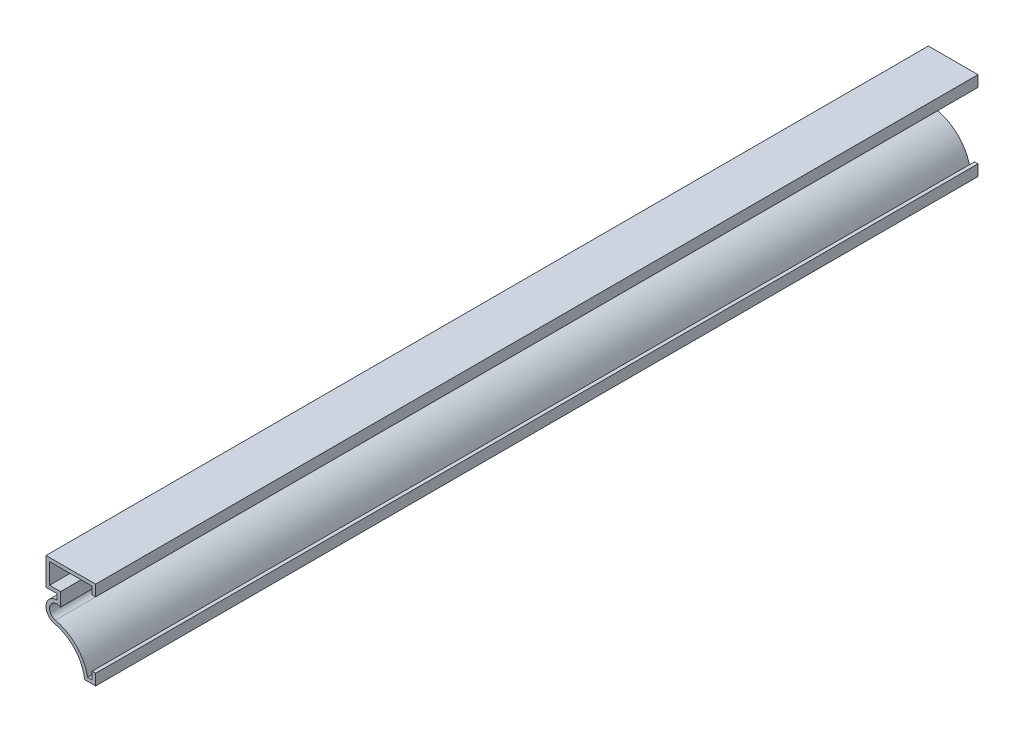
ISO-10303-21;
HEADER;
FILE_DESCRIPTION(('STEP AP214'),'2;1');
FILE_NAME('part.step','',(''),(''),'','','');
FILE_SCHEMA(('AUTOMOTIVE_DESIGN { 1 0 10303 214 1 1 1 1 }'));
ENDSEC;
DATA;
#1=APPLICATION_CONTEXT('core data for automotive mechanical design processes');
#2=APPLICATION_PROTOCOL_DEFINITION('international standard','automotive_design',2000,#1);
#3=PRODUCT_CONTEXT('',#1,'mechanical');
#4=PRODUCT('Part','Part','',(#3));
#5=PRODUCT_RELATED_PRODUCT_CATEGORY('part','',(#4));
#6=PRODUCT_DEFINITION_FORMATION('','',#4);
#7=PRODUCT_DEFINITION_CONTEXT('part definition',#1,'design');
#8=PRODUCT_DEFINITION('design','',#6,#7);
#9=PRODUCT_DEFINITION_SHAPE('','',#8);
#10=(LENGTH_UNIT() NAMED_UNIT(*) SI_UNIT(.MILLI.,.METRE.));
#11=(NAMED_UNIT(*) PLANE_ANGLE_UNIT() SI_UNIT($,.RADIAN.));
#12=(NAMED_UNIT(*) SI_UNIT($,.STERADIAN.) SOLID_ANGLE_UNIT());
#13=UNCERTAINTY_MEASURE_WITH_UNIT(LENGTH_MEASURE(1.E-05),#10,'distance_accuracy_value','');
#14=(GEOMETRIC_REPRESENTATION_CONTEXT(3) GLOBAL_UNCERTAINTY_ASSIGNED_CONTEXT((#13)) GLOBAL_UNIT_ASSIGNED_CONTEXT((#10,
#11,#12)) REPRESENTATION_CONTEXT('',''));
#15=CARTESIAN_POINT('',(0.,0.,0.));
#16=DIRECTION('',(0.,0.,1.));
#17=DIRECTION('',(1.,0.,0.));
#18=AXIS2_PLACEMENT_3D('',#15,#16,#17);
#19=CARTESIAN_POINT('',(-1.016,22.225,-254.));
#20=DIRECTION('',(-1.,0.,0.));
#21=DIRECTION('',(0.,0.,1.));
#22=AXIS2_PLACEMENT_3D('',#19,#20,#21);
#23=PLANE('',#22);
#24=DIRECTION('',(0.,1.,0.));
#25=VECTOR('',#24,1.);
#26=CARTESIAN_POINT('',(-1.016,22.225,0.));
#27=LINE('',#26,#25);
#28=CARTESIAN_POINT('',(-1.016,24.384,0.));
#29=VERTEX_POINT('',#28);
#30=CARTESIAN_POINT('',(-1.016,22.225,0.));
#31=VERTEX_POINT('',#30);
#32=EDGE_CURVE('E203',#29,#31,#27,.F.);
#33=ORIENTED_EDGE('',*,*,#32,.F.);
#34=DIRECTION('',(0.,0.,1.));
#35=VECTOR('',#34,1.);
#36=CARTESIAN_POINT('',(-1.016,24.384,-254.));
#37=LINE('',#36,#35);
#38=CARTESIAN_POINT('',(-1.016,24.384,-254.));
#39=VERTEX_POINT('',#38);
#40=EDGE_CURVE('E11',#39,#29,#37,.T.);
#41=ORIENTED_EDGE('',*,*,#40,.F.);
#42=DIRECTION('',(0.,1.,0.));
#43=VECTOR('',#42,1.);
#44=CARTESIAN_POINT('',(-1.016,22.225,-254.));
#45=LINE('',#44,#43);
#46=CARTESIAN_POINT('',(-1.016,22.225,-254.));
#47=VERTEX_POINT('',#46);
#48=EDGE_CURVE('E249',#39,#47,#45,.F.);
#49=ORIENTED_EDGE('',*,*,#48,.T.);
#50=DIRECTION('',(0.,0.,1.));
#51=VECTOR('',#50,1.);
#52=CARTESIAN_POINT('',(-1.016,22.225,-254.));
#53=LINE('',#52,#51);
#54=EDGE_CURVE('E38',#47,#31,#53,.T.);
#55=ORIENTED_EDGE('',*,*,#54,.T.);
#56=EDGE_LOOP('',(#33,#41,#49,#55));
#57=FACE_BOUND('',#56,.T.);
#58=ADVANCED_FACE('F35',(#57),#23,.T.);
#59=CARTESIAN_POINT('',(0.,24.384,-254.));
#60=DIRECTION('',(0.,-1.,0.));
#61=DIRECTION('',(1.,0.,0.));
#62=AXIS2_PLACEMENT_3D('',#59,#60,#61);
#63=PLANE('',#62);
#64=DIRECTION('',(1.,0.,0.));
#65=VECTOR('',#64,1.);
#66=CARTESIAN_POINT('',(0.,24.384,0.));
#67=LINE('',#66,#65);
#68=CARTESIAN_POINT('',(-13.2715,24.384,0.));
#69=VERTEX_POINT('',#68);
#70=EDGE_CURVE('E247',#69,#29,#67,.T.);
#71=ORIENTED_EDGE('',*,*,#70,.F.);
#72=DIRECTION('',(0.,0.,1.));
#73=VECTOR('',#72,1.);
#74=CARTESIAN_POINT('',(-13.2715,24.384,-254.));
#75=LINE('',#74,#73);
#76=CARTESIAN_POINT('',(-13.2715,24.384,-254.));
#77=VERTEX_POINT('',#76);
#78=EDGE_CURVE('E44',#77,#69,#75,.T.);
#79=ORIENTED_EDGE('',*,*,#78,.F.);
#80=DIRECTION('',(1.,0.,0.));
#81=VECTOR('',#80,1.);
#82=CARTESIAN_POINT('',(0.,24.384,-254.));
#83=LINE('',#82,#81);
#84=EDGE_CURVE('E193',#77,#39,#83,.T.);
#85=ORIENTED_EDGE('',*,*,#84,.T.);
#86=ORIENTED_EDGE('',*,*,#40,.T.);
#87=EDGE_LOOP('',(#71,#79,#85,#86));
#88=FACE_BOUND('',#87,.T.);
#89=ADVANCED_FACE('F298',(#88),#63,.T.);
#90=CARTESIAN_POINT('',(-13.2715,25.4,-254.));
#91=DIRECTION('',(1.,0.,0.));
#92=DIRECTION('',(0.,1.,0.));
#93=AXIS2_PLACEMENT_3D('',#90,#91,#92);
#94=PLANE('',#93);
#95=DIRECTION('',(0.,1.,0.));
#96=VECTOR('',#95,1.);
#97=CARTESIAN_POINT('',(-13.2715,25.4,0.));
#98=LINE('',#97,#96);
#99=CARTESIAN_POINT('',(-13.2715,18.4785,0.));
#100=VERTEX_POINT('',#99);
#101=EDGE_CURVE('E181',#100,#69,#98,.T.);
#102=ORIENTED_EDGE('',*,*,#101,.F.);
#103=DIRECTION('',(0.,0.,1.));
#104=VECTOR('',#103,1.);
#105=CARTESIAN_POINT('',(-13.2715,18.4785,-254.));
#106=LINE('',#105,#104);
#107=CARTESIAN_POINT('',(-13.2715,18.4785,-254.));
#108=VERTEX_POINT('',#107);
#109=EDGE_CURVE('E176',#108,#100,#106,.T.);
#110=ORIENTED_EDGE('',*,*,#109,.F.);
#111=DIRECTION('',(0.,1.,0.));
#112=VECTOR('',#111,1.);
#113=CARTESIAN_POINT('',(-13.2715,25.4,-254.));
#114=LINE('',#113,#112);
#115=EDGE_CURVE('E179',#108,#77,#114,.T.);
#116=ORIENTED_EDGE('',*,*,#115,.T.);
#117=ORIENTED_EDGE('',*,*,#78,.T.);
#118=EDGE_LOOP('',(#102,#110,#116,#117));
#119=FACE_BOUND('',#118,.T.);
#120=ADVANCED_FACE('F178',(#119),#94,.T.);
#121=CARTESIAN_POINT('',(-14.2875,18.4785,-254.));
#122=DIRECTION('',(0.,1.,0.));
#123=DIRECTION('',(-1.,0.,0.));
#124=AXIS2_PLACEMENT_3D('',#121,#122,#123);
#125=PLANE('',#124);
#126=DIRECTION('',(-1.,0.,0.));
#127=VECTOR('',#126,1.);
#128=CARTESIAN_POINT('',(-14.2875,18.4785,0.));
#129=LINE('',#128,#127);
#130=CARTESIAN_POINT('',(-10.0965,18.4785,0.));
#131=VERTEX_POINT('',#130);
#132=EDGE_CURVE('E244',#131,#100,#129,.T.);
#133=ORIENTED_EDGE('',*,*,#132,.F.);
#134=DIRECTION('',(0.,0.,1.));
#135=VECTOR('',#134,1.);
#136=CARTESIAN_POINT('',(-10.0965,18.4785,-254.));
#137=LINE('',#136,#135);
#138=CARTESIAN_POINT('',(-10.0965,18.4785,-254.));
#139=VERTEX_POINT('',#138);
#140=EDGE_CURVE('E186',#139,#131,#137,.T.);
#141=ORIENTED_EDGE('',*,*,#140,.F.);
#142=DIRECTION('',(-1.,0.,0.));
#143=VECTOR('',#142,1.);
#144=CARTESIAN_POINT('',(-14.2875,18.4785,-254.));
#145=LINE('',#144,#143);
#146=EDGE_CURVE('E191',#139,#108,#145,.T.);
#147=ORIENTED_EDGE('',*,*,#146,.T.);
#148=ORIENTED_EDGE('',*,*,#109,.T.);
#149=EDGE_LOOP('',(#133,#141,#147,#148));
#150=FACE_BOUND('',#149,.T.);
#151=ADVANCED_FACE('F195',(#150),#125,.T.);
#152=CARTESIAN_POINT('',(-10.0965,17.4625,-254.));
#153=DIRECTION('',(1.,0.,0.));
#154=DIRECTION('',(0.,1.,0.));
#155=AXIS2_PLACEMENT_3D('',#152,#153,#154);
#156=PLANE('',#155);
#157=DIRECTION('',(0.,1.,0.));
#158=VECTOR('',#157,1.);
#159=CARTESIAN_POINT('',(-10.0965,17.4625,0.));
#160=LINE('',#159,#158);
#161=CARTESIAN_POINT('',(-10.0965,14.605,0.));
#162=VERTEX_POINT('',#161);
#163=EDGE_CURVE('E241',#162,#131,#160,.T.);
#164=ORIENTED_EDGE('',*,*,#163,.F.);
#165=DIRECTION('',(0.,0.,1.));
#166=VECTOR('',#165,1.);
#167=CARTESIAN_POINT('',(-10.0965,14.605,-254.));
#168=LINE('',#167,#166);
#169=CARTESIAN_POINT('',(-10.0965,14.605,-254.));
#170=VERTEX_POINT('',#169);
#171=EDGE_CURVE('E253',#170,#162,#168,.T.);
#172=ORIENTED_EDGE('',*,*,#171,.F.);
#173=DIRECTION('',(0.,1.,0.));
#174=VECTOR('',#173,1.);
#175=CARTESIAN_POINT('',(-10.0965,17.4625,-254.));
#176=LINE('',#175,#174);
#177=EDGE_CURVE('E196',#170,#139,#176,.T.);
#178=ORIENTED_EDGE('',*,*,#177,.T.);
#179=ORIENTED_EDGE('',*,*,#140,.T.);
#180=EDGE_LOOP('',(#164,#172,#178,#179));
#181=FACE_BOUND('',#180,.T.);
#182=ADVANCED_FACE('F311',(#181),#156,.T.);
#183=CARTESIAN_POINT('',(-11.1125,12.7,-254.));
#184=DIRECTION('',(0.,0.,1.));
#185=DIRECTION('',(1.,0.,0.));
#186=AXIS2_PLACEMENT_3D('',#183,#184,#185);
#187=CYLINDRICAL_SURFACE('',#186,2.159);
#188=CARTESIAN_POINT('',(-11.1125,12.7,0.));
#189=DIRECTION('',(0.,0.,1.));
#190=DIRECTION('',(1.,0.,0.));
#191=AXIS2_PLACEMENT_3D('',#188,#189,#190);
#192=CIRCLE('',#191,2.159);
#193=CARTESIAN_POINT('',(-11.5897113535966,10.594400246011,0.));
#194=VERTEX_POINT('',#193);
#195=EDGE_CURVE('E238',#194,#162,#192,.F.);
#196=ORIENTED_EDGE('',*,*,#195,.F.);
#197=DIRECTION('',(0.,0.,1.));
#198=VECTOR('',#197,1.);
#199=CARTESIAN_POINT('',(-11.5897113535966,10.594400246011,-254.));
#200=LINE('',#199,#198);
#201=CARTESIAN_POINT('',(-11.5897113535966,10.594400246011,-254.));
#202=VERTEX_POINT('',#201);
#203=EDGE_CURVE('E255',#202,#194,#200,.T.);
#204=ORIENTED_EDGE('',*,*,#203,.F.);
#205=CARTESIAN_POINT('',(-11.1125,12.7,-254.));
#206=DIRECTION('',(0.,0.,1.));
#207=DIRECTION('',(1.,0.,0.));
#208=AXIS2_PLACEMENT_3D('',#205,#206,#207);
#209=CIRCLE('',#208,2.159);
#210=EDGE_CURVE('E198',#202,#170,#209,.F.);
#211=ORIENTED_EDGE('',*,*,#210,.T.);
#212=ORIENTED_EDGE('',*,*,#171,.T.);
#213=EDGE_LOOP('',(#196,#204,#211,#212));
#214=FACE_BOUND('',#213,.T.);
#215=ADVANCED_FACE('F314',(#214),#187,.F.);
#216=CARTESIAN_POINT('',(-14.2875,-1.30905315544039,-254.));
#217=DIRECTION('',(0.,0.,1.));
#218=DIRECTION('',(1.,0.,0.));
#219=AXIS2_PLACEMENT_3D('',#216,#217,#218);
#220=CYLINDRICAL_SURFACE('',#219,12.2053376217615);
#221=CARTESIAN_POINT('',(-14.2875,-1.30905315544039,0.));
#222=DIRECTION('',(0.,0.,1.));
#223=DIRECTION('',(1.,0.,0.));
#224=AXIS2_PLACEMENT_3D('',#221,#222,#223);
#225=CIRCLE('',#224,12.2053376217615);
#226=CARTESIAN_POINT('',(-2.30566398519974,1.016,0.));
#227=VERTEX_POINT('',#226);
#228=EDGE_CURVE('E235',#227,#194,#225,.T.);
#229=ORIENTED_EDGE('',*,*,#228,.F.);
#230=DIRECTION('',(0.,0.,1.));
#231=VECTOR('',#230,1.);
#232=CARTESIAN_POINT('',(-2.30566398519974,1.016,-254.));
#233=LINE('',#232,#231);
#234=CARTESIAN_POINT('',(-2.30566398519974,1.016,-254.));
#235=VERTEX_POINT('',#234);
#236=EDGE_CURVE('E257',#235,#227,#233,.T.);
#237=ORIENTED_EDGE('',*,*,#236,.F.);
#238=CARTESIAN_POINT('',(-14.2875,-1.30905315544039,-254.));
#239=DIRECTION('',(0.,0.,1.));
#240=DIRECTION('',(1.,0.,0.));
#241=AXIS2_PLACEMENT_3D('',#238,#239,#240);
#242=CIRCLE('',#241,12.2053376217615);
#243=EDGE_CURVE('E553',#235,#202,#242,.T.);
#244=ORIENTED_EDGE('',*,*,#243,.T.);
#245=ORIENTED_EDGE('',*,*,#203,.T.);
#246=EDGE_LOOP('',(#229,#237,#244,#245));
#247=FACE_BOUND('',#246,.T.);
#248=ADVANCED_FACE('F318',(#247),#220,.T.);
#249=CARTESIAN_POINT('',(0.,1.016,-254.));
#250=DIRECTION('',(0.,1.,0.));
#251=DIRECTION('',(-1.,0.,0.));
#252=AXIS2_PLACEMENT_3D('',#249,#250,#251);
#253=PLANE('',#252);
#254=DIRECTION('',(-1.,0.,0.));
#255=VECTOR('',#254,1.);
#256=CARTESIAN_POINT('',(0.,1.016,0.));
#257=LINE('',#256,#255);
#258=CARTESIAN_POINT('',(-1.016,1.016,0.));
#259=VERTEX_POINT('',#258);
#260=EDGE_CURVE('E232',#259,#227,#257,.T.);
#261=ORIENTED_EDGE('',*,*,#260,.F.);
#262=DIRECTION('',(0.,0.,1.));
#263=VECTOR('',#262,1.);
#264=CARTESIAN_POINT('',(-1.016,1.016,-254.));
#265=LINE('',#264,#263);
#266=CARTESIAN_POINT('',(-1.016,1.016,-254.));
#267=VERTEX_POINT('',#266);
#268=EDGE_CURVE('E259',#267,#259,#265,.T.);
#269=ORIENTED_EDGE('',*,*,#268,.F.);
#270=DIRECTION('',(-1.,0.,0.));
#271=VECTOR('',#270,1.);
#272=CARTESIAN_POINT('',(0.,1.016,-254.));
#273=LINE('',#272,#271);
#274=EDGE_CURVE('E557',#267,#235,#273,.T.);
#275=ORIENTED_EDGE('',*,*,#274,.T.);
#276=ORIENTED_EDGE('',*,*,#236,.T.);
#277=EDGE_LOOP('',(#261,#269,#275,#276));
#278=FACE_BOUND('',#277,.T.);
#279=ADVANCED_FACE('F322',(#278),#253,.T.);
#280=CARTESIAN_POINT('',(-1.016,3.175,-254.));
#281=DIRECTION('',(-1.,0.,0.));
#282=DIRECTION('',(0.,0.,1.));
#283=AXIS2_PLACEMENT_3D('',#280,#281,#282);
#284=PLANE('',#283);
#285=DIRECTION('',(0.,1.,0.));
#286=VECTOR('',#285,1.);
#287=CARTESIAN_POINT('',(-1.016,3.175,0.));
#288=LINE('',#287,#286);
#289=CARTESIAN_POINT('',(-1.016,3.175,0.));
#290=VERTEX_POINT('',#289);
#291=EDGE_CURVE('E229',#290,#259,#288,.F.);
#292=ORIENTED_EDGE('',*,*,#291,.F.);
#293=DIRECTION('',(0.,0.,1.));
#294=VECTOR('',#293,1.);
#295=CARTESIAN_POINT('',(-1.016,3.175,-254.));
#296=LINE('',#295,#294);
#297=CARTESIAN_POINT('',(-1.016,3.175,-254.));
#298=VERTEX_POINT('',#297);
#299=EDGE_CURVE('E261',#298,#290,#296,.T.);
#300=ORIENTED_EDGE('',*,*,#299,.F.);
#301=DIRECTION('',(0.,1.,0.));
#302=VECTOR('',#301,1.);
#303=CARTESIAN_POINT('',(-1.016,3.175,-254.));
#304=LINE('',#303,#302);
#305=EDGE_CURVE('E546',#298,#267,#304,.F.);
#306=ORIENTED_EDGE('',*,*,#305,.T.);
#307=ORIENTED_EDGE('',*,*,#268,.T.);
#308=EDGE_LOOP('',(#292,#300,#306,#307));
#309=FACE_BOUND('',#308,.T.);
#310=ADVANCED_FACE('F326',(#309),#284,.T.);
#311=CARTESIAN_POINT('',(-1.016,3.175,-254.));
#312=DIRECTION('',(0.,-1.,0.));
#313=DIRECTION('',(0.,0.,-1.));
#314=AXIS2_PLACEMENT_3D('',#311,#312,#313);
#315=PLANE('',#314);
#316=DIRECTION('',(1.,0.,0.));
#317=VECTOR('',#316,1.);
#318=CARTESIAN_POINT('',(-1.016,3.175,0.));
#319=LINE('',#318,#317);
#320=CARTESIAN_POINT('',(0.,3.175,0.));
#321=VERTEX_POINT('',#320);
#322=EDGE_CURVE('E227',#290,#321,#319,.T.);
#323=ORIENTED_EDGE('',*,*,#322,.T.);
#324=DIRECTION('',(0.,0.,1.));
#325=VECTOR('',#324,1.);
#326=CARTESIAN_POINT('',(0.,3.175,-254.));
#327=LINE('',#326,#325);
#328=CARTESIAN_POINT('',(0.,3.175,-254.));
#329=VERTEX_POINT('',#328);
#330=EDGE_CURVE('E263',#329,#321,#327,.T.);
#331=ORIENTED_EDGE('',*,*,#330,.F.);
#332=DIRECTION('',(1.,0.,0.));
#333=VECTOR('',#332,1.);
#334=CARTESIAN_POINT('',(-1.016,3.175,-254.));
#335=LINE('',#334,#333);
#336=EDGE_CURVE('E541',#298,#329,#335,.T.);
#337=ORIENTED_EDGE('',*,*,#336,.F.);
#338=ORIENTED_EDGE('',*,*,#299,.T.);
#339=EDGE_LOOP('',(#323,#331,#337,#338));
#340=FACE_BOUND('',#339,.T.);
#341=ADVANCED_FACE('F330',(#340),#315,.F.);
#342=CARTESIAN_POINT('',(0.,3.175,-254.));
#343=DIRECTION('',(-1.,0.,0.));
#344=DIRECTION('',(0.,0.,1.));
#345=AXIS2_PLACEMENT_3D('',#342,#343,#344);
#346=PLANE('',#345);
#347=DIRECTION('',(0.,-1.,0.));
#348=VECTOR('',#347,1.);
#349=CARTESIAN_POINT('',(0.,3.175,0.));
#350=LINE('',#349,#348);
#351=CARTESIAN_POINT('',(0.,0.,0.));
#352=VERTEX_POINT('',#351);
#353=EDGE_CURVE('E225',#321,#352,#350,.T.);
#354=ORIENTED_EDGE('',*,*,#353,.T.);
#355=DIRECTION('',(0.,0.,1.));
#356=VECTOR('',#355,1.);
#357=CARTESIAN_POINT('',(0.,0.,-254.));
#358=LINE('',#357,#356);
#359=CARTESIAN_POINT('',(0.,0.,-254.));
#360=VERTEX_POINT('',#359);
#361=EDGE_CURVE('E266',#360,#352,#358,.T.);
#362=ORIENTED_EDGE('',*,*,#361,.F.);
#363=DIRECTION('',(0.,-1.,0.));
#364=VECTOR('',#363,1.);
#365=CARTESIAN_POINT('',(0.,3.175,-254.));
#366=LINE('',#365,#364);
#367=EDGE_CURVE('E538',#329,#360,#366,.T.);
#368=ORIENTED_EDGE('',*,*,#367,.F.);
#369=ORIENTED_EDGE('',*,*,#330,.T.);
#370=EDGE_LOOP('',(#354,#362,#368,#369));
#371=FACE_BOUND('',#370,.T.);
#372=ADVANCED_FACE('F334',(#371),#346,.F.);
#373=CARTESIAN_POINT('',(0.,0.,-254.));
#374=DIRECTION('',(0.,1.,0.));
#375=DIRECTION('',(-1.,0.,0.));
#376=AXIS2_PLACEMENT_3D('',#373,#374,#375);
#377=PLANE('',#376);
#378=DIRECTION('',(-1.,0.,0.));
#379=VECTOR('',#378,1.);
#380=CARTESIAN_POINT('',(0.,0.,0.));
#381=LINE('',#380,#379);
#382=CARTESIAN_POINT('',(-3.175,0.,0.));
#383=VERTEX_POINT('',#382);
#384=EDGE_CURVE('E223',#352,#383,#381,.T.);
#385=ORIENTED_EDGE('',*,*,#384,.T.);
#386=DIRECTION('',(0.,0.,1.));
#387=VECTOR('',#386,1.);
#388=CARTESIAN_POINT('',(-3.175,0.,-254.));
#389=LINE('',#388,#387);
#390=CARTESIAN_POINT('',(-3.175,0.,-254.));
#391=VERTEX_POINT('',#390);
#392=EDGE_CURVE('E269',#391,#383,#389,.T.);
#393=ORIENTED_EDGE('',*,*,#392,.F.);
#394=DIRECTION('',(-1.,0.,0.));
#395=VECTOR('',#394,1.);
#396=CARTESIAN_POINT('',(0.,0.,-254.));
#397=LINE('',#396,#395);
#398=EDGE_CURVE('E536',#360,#391,#397,.T.);
#399=ORIENTED_EDGE('',*,*,#398,.F.);
#400=ORIENTED_EDGE('',*,*,#361,.T.);
#401=EDGE_LOOP('',(#385,#393,#399,#400));
#402=FACE_BOUND('',#401,.T.);
#403=ADVANCED_FACE('F338',(#402),#377,.F.);
#404=CARTESIAN_POINT('',(-14.2875,-1.30905315544039,-254.));
#405=DIRECTION('',(0.,0.,1.));
#406=DIRECTION('',(1.,0.,0.));
#407=AXIS2_PLACEMENT_3D('',#404,#405,#406);
#408=CYLINDRICAL_SURFACE('',#407,11.1893376217615);
#409=CARTESIAN_POINT('',(-14.2875,-1.30905315544039,0.));
#410=DIRECTION('',(0.,0.,1.));
#411=DIRECTION('',(-1.,0.,0.));
#412=AXIS2_PLACEMENT_3D('',#409,#410,#411);
#413=CIRCLE('',#412,11.1893376217615);
#414=CARTESIAN_POINT('',(-11.814281402348,9.60352977354561,0.));
#415=VERTEX_POINT('',#414);
#416=EDGE_CURVE('E221',#383,#415,#413,.T.);
#417=ORIENTED_EDGE('',*,*,#416,.T.);
#418=DIRECTION('',(0.,0.,1.));
#419=VECTOR('',#418,1.);
#420=CARTESIAN_POINT('',(-11.814281402348,9.60352977354561,-254.));
#421=LINE('',#420,#419);
#422=CARTESIAN_POINT('',(-11.814281402348,9.60352977354561,-254.));
#423=VERTEX_POINT('',#422);
#424=EDGE_CURVE('E272',#423,#415,#421,.T.);
#425=ORIENTED_EDGE('',*,*,#424,.F.);
#426=CARTESIAN_POINT('',(-14.2875,-1.30905315544039,-254.));
#427=DIRECTION('',(0.,0.,1.));
#428=DIRECTION('',(-1.,0.,0.));
#429=AXIS2_PLACEMENT_3D('',#426,#427,#428);
#430=CIRCLE('',#429,11.1893376217615);
#431=EDGE_CURVE('E529',#391,#423,#430,.T.);
#432=ORIENTED_EDGE('',*,*,#431,.F.);
#433=ORIENTED_EDGE('',*,*,#392,.T.);
#434=EDGE_LOOP('',(#417,#425,#432,#433));
#435=FACE_BOUND('',#434,.T.);
#436=ADVANCED_FACE('F342',(#435),#408,.F.);
#437=CARTESIAN_POINT('',(-11.1125,12.7,-254.));
#438=DIRECTION('',(0.,0.,1.));
#439=DIRECTION('',(1.,0.,0.));
#440=AXIS2_PLACEMENT_3D('',#437,#438,#439);
#441=CYLINDRICAL_SURFACE('',#440,3.175);
#442=CARTESIAN_POINT('',(-11.1125,12.7,0.));
#443=DIRECTION('',(0.,0.,-1.));
#444=DIRECTION('',(1.,0.,0.));
#445=AXIS2_PLACEMENT_3D('',#442,#443,#444);
#446=CIRCLE('',#445,3.175);
#447=CARTESIAN_POINT('',(-11.1125,15.875,0.));
#448=VERTEX_POINT('',#447);
#449=EDGE_CURVE('E219',#415,#448,#446,.T.);
#450=ORIENTED_EDGE('',*,*,#449,.T.);
#451=DIRECTION('',(0.,0.,1.));
#452=VECTOR('',#451,1.);
#453=CARTESIAN_POINT('',(-11.1125,15.875,-254.));
#454=LINE('',#453,#452);
#455=CARTESIAN_POINT('',(-11.1125,15.875,-254.));
#456=VERTEX_POINT('',#455);
#457=EDGE_CURVE('E275',#456,#448,#454,.T.);
#458=ORIENTED_EDGE('',*,*,#457,.F.);
#459=CARTESIAN_POINT('',(-11.1125,12.7,-254.));
#460=DIRECTION('',(0.,0.,-1.));
#461=DIRECTION('',(1.,0.,0.));
#462=AXIS2_PLACEMENT_3D('',#459,#460,#461);
#463=CIRCLE('',#462,3.175);
#464=EDGE_CURVE('E526',#423,#456,#463,.T.);
#465=ORIENTED_EDGE('',*,*,#464,.F.);
#466=ORIENTED_EDGE('',*,*,#424,.T.);
#467=EDGE_LOOP('',(#450,#458,#465,#466));
#468=FACE_BOUND('',#467,.T.);
#469=ADVANCED_FACE('F346',(#468),#441,.T.);
#470=CARTESIAN_POINT('',(-11.1125,17.4625,-254.));
#471=DIRECTION('',(1.,0.,0.));
#472=DIRECTION('',(0.,1.,0.));
#473=AXIS2_PLACEMENT_3D('',#470,#471,#472);
#474=PLANE('',#473);
#475=DIRECTION('',(0.,1.,0.));
#476=VECTOR('',#475,1.);
#477=CARTESIAN_POINT('',(-11.1125,17.4625,0.));
#478=LINE('',#477,#476);
#479=CARTESIAN_POINT('',(-11.1125,17.4625,0.));
#480=VERTEX_POINT('',#479);
#481=EDGE_CURVE('E217',#448,#480,#478,.T.);
#482=ORIENTED_EDGE('',*,*,#481,.T.);
#483=DIRECTION('',(0.,0.,1.));
#484=VECTOR('',#483,1.);
#485=CARTESIAN_POINT('',(-11.1125,17.4625,-254.));
#486=LINE('',#485,#484);
#487=CARTESIAN_POINT('',(-11.1125,17.4625,-254.));
#488=VERTEX_POINT('',#487);
#489=EDGE_CURVE('E278',#488,#480,#486,.T.);
#490=ORIENTED_EDGE('',*,*,#489,.F.);
#491=DIRECTION('',(0.,1.,0.));
#492=VECTOR('',#491,1.);
#493=CARTESIAN_POINT('',(-11.1125,17.4625,-254.));
#494=LINE('',#493,#492);
#495=EDGE_CURVE('E524',#456,#488,#494,.T.);
#496=ORIENTED_EDGE('',*,*,#495,.F.);
#497=ORIENTED_EDGE('',*,*,#457,.T.);
#498=EDGE_LOOP('',(#482,#490,#496,#497));
#499=FACE_BOUND('',#498,.T.);
#500=ADVANCED_FACE('F350',(#499),#474,.F.);
#501=CARTESIAN_POINT('',(-14.2875,17.4625,-254.));
#502=DIRECTION('',(0.,1.,0.));
#503=DIRECTION('',(-1.,0.,0.));
#504=AXIS2_PLACEMENT_3D('',#501,#502,#503);
#505=PLANE('',#504);
#506=DIRECTION('',(-1.,0.,0.));
#507=VECTOR('',#506,1.);
#508=CARTESIAN_POINT('',(-14.2875,17.4625,0.));
#509=LINE('',#508,#507);
#510=CARTESIAN_POINT('',(-14.2875,17.4625,0.));
#511=VERTEX_POINT('',#510);
#512=EDGE_CURVE('E215',#480,#511,#509,.T.);
#513=ORIENTED_EDGE('',*,*,#512,.T.);
#514=DIRECTION('',(0.,0.,1.));
#515=VECTOR('',#514,1.);
#516=CARTESIAN_POINT('',(-14.2875,17.4625,-254.));
#517=LINE('',#516,#515);
#518=CARTESIAN_POINT('',(-14.2875,17.4625,-254.));
#519=VERTEX_POINT('',#518);
#520=EDGE_CURVE('E281',#519,#511,#517,.T.);
#521=ORIENTED_EDGE('',*,*,#520,.F.);
#522=DIRECTION('',(-1.,0.,0.));
#523=VECTOR('',#522,1.);
#524=CARTESIAN_POINT('',(-14.2875,17.4625,-254.));
#525=LINE('',#524,#523);
#526=EDGE_CURVE('E517',#488,#519,#525,.T.);
#527=ORIENTED_EDGE('',*,*,#526,.F.);
#528=ORIENTED_EDGE('',*,*,#489,.T.);
#529=EDGE_LOOP('',(#513,#521,#527,#528));
#530=FACE_BOUND('',#529,.T.);
#531=ADVANCED_FACE('F354',(#530),#505,.F.);
#532=CARTESIAN_POINT('',(-14.2875,25.4,-254.));
#533=DIRECTION('',(1.,0.,0.));
#534=DIRECTION('',(0.,1.,0.));
#535=AXIS2_PLACEMENT_3D('',#532,#533,#534);
#536=PLANE('',#535);
#537=DIRECTION('',(0.,1.,0.));
#538=VECTOR('',#537,1.);
#539=CARTESIAN_POINT('',(-14.2875,25.4,0.));
#540=LINE('',#539,#538);
#541=CARTESIAN_POINT('',(-14.2875,25.4,0.));
#542=VERTEX_POINT('',#541);
#543=EDGE_CURVE('E213',#511,#542,#540,.T.);
#544=ORIENTED_EDGE('',*,*,#543,.T.);
#545=DIRECTION('',(0.,0.,1.));
#546=VECTOR('',#545,1.);
#547=CARTESIAN_POINT('',(-14.2875,25.4,-254.));
#548=LINE('',#547,#546);
#549=CARTESIAN_POINT('',(-14.2875,25.4,-254.));
#550=VERTEX_POINT('',#549);
#551=EDGE_CURVE('E284',#550,#542,#548,.T.);
#552=ORIENTED_EDGE('',*,*,#551,.F.);
#553=DIRECTION('',(0.,1.,0.));
#554=VECTOR('',#553,1.);
#555=CARTESIAN_POINT('',(-14.2875,25.4,-254.));
#556=LINE('',#555,#554);
#557=EDGE_CURVE('E514',#519,#550,#556,.T.);
#558=ORIENTED_EDGE('',*,*,#557,.F.);
#559=ORIENTED_EDGE('',*,*,#520,.T.);
#560=EDGE_LOOP('',(#544,#552,#558,#559));
#561=FACE_BOUND('',#560,.T.);
#562=ADVANCED_FACE('F358',(#561),#536,.F.);
#563=CARTESIAN_POINT('',(0.,25.4,-254.));
#564=DIRECTION('',(0.,-1.,0.));
#565=DIRECTION('',(1.,0.,0.));
#566=AXIS2_PLACEMENT_3D('',#563,#564,#565);
#567=PLANE('',#566);
#568=DIRECTION('',(1.,0.,0.));
#569=VECTOR('',#568,1.);
#570=CARTESIAN_POINT('',(0.,25.4,0.));
#571=LINE('',#570,#569);
#572=CARTESIAN_POINT('',(0.,25.4,0.));
#573=VERTEX_POINT('',#572);
#574=EDGE_CURVE('E211',#542,#573,#571,.T.);
#575=ORIENTED_EDGE('',*,*,#574,.T.);
#576=DIRECTION('',(0.,0.,1.));
#577=VECTOR('',#576,1.);
#578=CARTESIAN_POINT('',(0.,25.4,-254.));
#579=LINE('',#578,#577);
#580=CARTESIAN_POINT('',(0.,25.4,-254.));
#581=VERTEX_POINT('',#580);
#582=EDGE_CURVE('E287',#581,#573,#579,.T.);
#583=ORIENTED_EDGE('',*,*,#582,.F.);
#584=DIRECTION('',(1.,0.,0.));
#585=VECTOR('',#584,1.);
#586=CARTESIAN_POINT('',(0.,25.4,-254.));
#587=LINE('',#586,#585);
#588=EDGE_CURVE('E512',#550,#581,#587,.T.);
#589=ORIENTED_EDGE('',*,*,#588,.F.);
#590=ORIENTED_EDGE('',*,*,#551,.T.);
#591=EDGE_LOOP('',(#575,#583,#589,#590));
#592=FACE_BOUND('',#591,.T.);
#593=ADVANCED_FACE('F362',(#592),#567,.F.);
#594=CARTESIAN_POINT('',(0.,22.225,-254.));
#595=DIRECTION('',(-1.,0.,0.));
#596=DIRECTION('',(0.,0.,1.));
#597=AXIS2_PLACEMENT_3D('',#594,#595,#596);
#598=PLANE('',#597);
#599=DIRECTION('',(0.,-1.,0.));
#600=VECTOR('',#599,1.);
#601=CARTESIAN_POINT('',(0.,22.225,0.));
#602=LINE('',#601,#600);
#603=CARTESIAN_POINT('',(0.,22.225,0.));
#604=VERTEX_POINT('',#603);
#605=EDGE_CURVE('E209',#573,#604,#602,.T.);
#606=ORIENTED_EDGE('',*,*,#605,.T.);
#607=DIRECTION('',(0.,0.,1.));
#608=VECTOR('',#607,1.);
#609=CARTESIAN_POINT('',(0.,22.225,-254.));
#610=LINE('',#609,#608);
#611=CARTESIAN_POINT('',(0.,22.225,-254.));
#612=VERTEX_POINT('',#611);
#613=EDGE_CURVE('E289',#612,#604,#610,.T.);
#614=ORIENTED_EDGE('',*,*,#613,.F.);
#615=DIRECTION('',(0.,-1.,0.));
#616=VECTOR('',#615,1.);
#617=CARTESIAN_POINT('',(0.,22.225,-254.));
#618=LINE('',#617,#616);
#619=EDGE_CURVE('E571',#581,#612,#618,.T.);
#620=ORIENTED_EDGE('',*,*,#619,.F.);
#621=ORIENTED_EDGE('',*,*,#582,.T.);
#622=EDGE_LOOP('',(#606,#614,#620,#621));
#623=FACE_BOUND('',#622,.T.);
#624=ADVANCED_FACE('F366',(#623),#598,.F.);
#625=CARTESIAN_POINT('',(0.,22.225,-254.));
#626=DIRECTION('',(0.,1.,0.));
#627=DIRECTION('',(0.,0.,1.));
#628=AXIS2_PLACEMENT_3D('',#625,#626,#627);
#629=PLANE('',#628);
#630=DIRECTION('',(-1.,0.,0.));
#631=VECTOR('',#630,1.);
#632=CARTESIAN_POINT('',(0.,22.225,0.));
#633=LINE('',#632,#631);
#634=EDGE_CURVE('E206',#604,#31,#633,.T.);
#635=ORIENTED_EDGE('',*,*,#634,.T.);
#636=ORIENTED_EDGE('',*,*,#54,.F.);
#637=DIRECTION('',(-1.,0.,0.));
#638=VECTOR('',#637,1.);
#639=CARTESIAN_POINT('',(0.,22.225,-254.));
#640=LINE('',#639,#638);
#641=EDGE_CURVE('E127',#612,#47,#640,.T.);
#642=ORIENTED_EDGE('',*,*,#641,.F.);
#643=ORIENTED_EDGE('',*,*,#613,.T.);
#644=EDGE_LOOP('',(#635,#636,#642,#643));
#645=FACE_BOUND('',#644,.T.);
#646=ADVANCED_FACE('F294',(#645),#629,.F.);
#647=CARTESIAN_POINT('',(-11.1125,12.7,-254.));
#648=DIRECTION('',(0.,0.,-1.));
#649=DIRECTION('',(-1.,0.,0.));
#650=AXIS2_PLACEMENT_3D('',#647,#648,#649);
#651=PLANE('',#650);
#652=ORIENTED_EDGE('',*,*,#48,.F.);
#653=ORIENTED_EDGE('',*,*,#84,.F.);
#654=ORIENTED_EDGE('',*,*,#115,.F.);
#655=ORIENTED_EDGE('',*,*,#146,.F.);
#656=ORIENTED_EDGE('',*,*,#177,.F.);
#657=ORIENTED_EDGE('',*,*,#210,.F.);
#658=ORIENTED_EDGE('',*,*,#243,.F.);
#659=ORIENTED_EDGE('',*,*,#274,.F.);
#660=ORIENTED_EDGE('',*,*,#305,.F.);
#661=ORIENTED_EDGE('',*,*,#336,.T.);
#662=ORIENTED_EDGE('',*,*,#367,.T.);
#663=ORIENTED_EDGE('',*,*,#398,.T.);
#664=ORIENTED_EDGE('',*,*,#431,.T.);
#665=ORIENTED_EDGE('',*,*,#464,.T.);
#666=ORIENTED_EDGE('',*,*,#495,.T.);
#667=ORIENTED_EDGE('',*,*,#526,.T.);
#668=ORIENTED_EDGE('',*,*,#557,.T.);
#669=ORIENTED_EDGE('',*,*,#588,.T.);
#670=ORIENTED_EDGE('',*,*,#619,.T.);
#671=ORIENTED_EDGE('',*,*,#641,.T.);
#672=EDGE_LOOP('',(#652,#653,#654,#655,#656,#657,#658,#659,#660,#661,#662,#663,#664,#665,#666,
#667,#668,#669,#670,#671));
#673=FACE_BOUND('',#672,.T.);
#674=ADVANCED_FACE('F189',(#673),#651,.T.);
#675=CARTESIAN_POINT('',(-11.1125,12.7,0.));
#676=DIRECTION('',(0.,0.,-1.));
#677=DIRECTION('',(-1.,0.,0.));
#678=AXIS2_PLACEMENT_3D('',#675,#676,#677);
#679=PLANE('',#678);
#680=ORIENTED_EDGE('',*,*,#32,.T.);
#681=ORIENTED_EDGE('',*,*,#634,.F.);
#682=ORIENTED_EDGE('',*,*,#605,.F.);
#683=ORIENTED_EDGE('',*,*,#574,.F.);
#684=ORIENTED_EDGE('',*,*,#543,.F.);
#685=ORIENTED_EDGE('',*,*,#512,.F.);
#686=ORIENTED_EDGE('',*,*,#481,.F.);
#687=ORIENTED_EDGE('',*,*,#449,.F.);
#688=ORIENTED_EDGE('',*,*,#416,.F.);
#689=ORIENTED_EDGE('',*,*,#384,.F.);
#690=ORIENTED_EDGE('',*,*,#353,.F.);
#691=ORIENTED_EDGE('',*,*,#322,.F.);
#692=ORIENTED_EDGE('',*,*,#291,.T.);
#693=ORIENTED_EDGE('',*,*,#260,.T.);
#694=ORIENTED_EDGE('',*,*,#228,.T.);
#695=ORIENTED_EDGE('',*,*,#195,.T.);
#696=ORIENTED_EDGE('',*,*,#163,.T.);
#697=ORIENTED_EDGE('',*,*,#132,.T.);
#698=ORIENTED_EDGE('',*,*,#101,.T.);
#699=ORIENTED_EDGE('',*,*,#70,.T.);
#700=EDGE_LOOP('',(#680,#681,#682,#683,#684,#685,#686,#687,#688,#689,#690,#691,#692,#693,#694,
#695,#696,#697,#698,#699));
#701=FACE_BOUND('',#700,.T.);
#702=ADVANCED_FACE('F297',(#701),#679,.F.);
#703=CLOSED_SHELL('',(#58,#89,#120,#151,#182,#215,#248,#279,#310,#341,#372,#403,#436,#469,#500,
#531,#562,#593,#624,#646,#674,#702));
#704=MANIFOLD_SOLID_BREP('B2',#703);
#705=ADVANCED_BREP_SHAPE_REPRESENTATION('',(#18,#704),#14);
#706=SHAPE_DEFINITION_REPRESENTATION(#9,#705);
ENDSEC;
END-ISO-10303-21;
